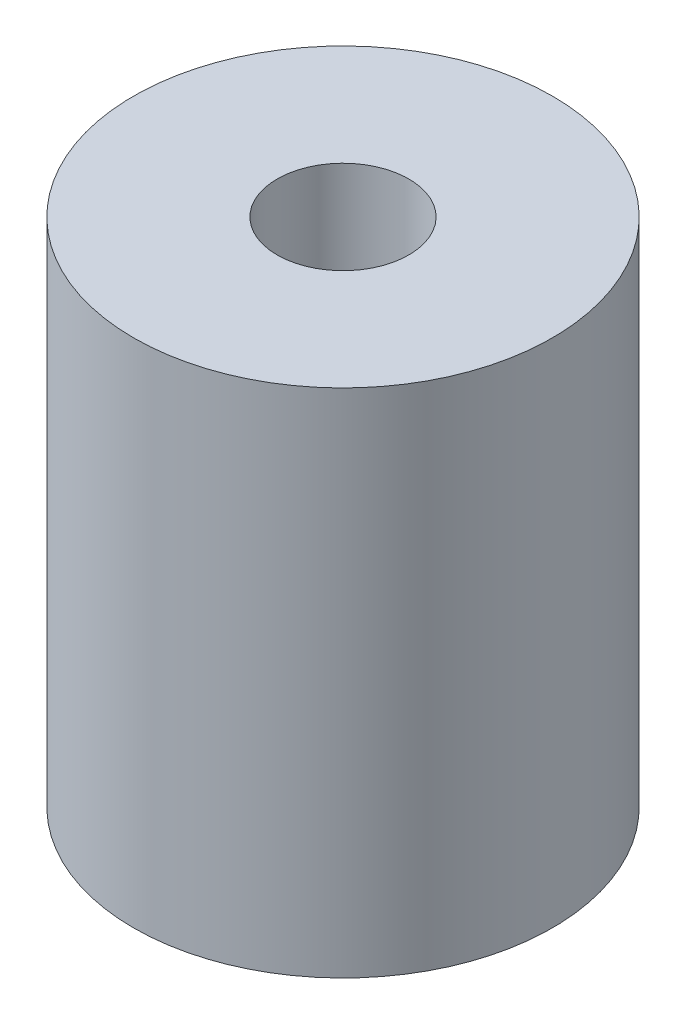
ISO-10303-21;
HEADER;
FILE_DESCRIPTION(('STEP AP214'),'2;1');
FILE_NAME('part.step','',(''),(''),'','','');
FILE_SCHEMA(('AUTOMOTIVE_DESIGN { 1 0 10303 214 1 1 1 1 }'));
ENDSEC;
DATA;
#1=APPLICATION_CONTEXT('core data for automotive mechanical design processes');
#2=APPLICATION_PROTOCOL_DEFINITION('international standard','automotive_design',2000,#1);
#3=PRODUCT_CONTEXT('',#1,'mechanical');
#4=PRODUCT('Part','Part','',(#3));
#5=PRODUCT_RELATED_PRODUCT_CATEGORY('part','',(#4));
#6=PRODUCT_DEFINITION_FORMATION('','',#4);
#7=PRODUCT_DEFINITION_CONTEXT('part definition',#1,'design');
#8=PRODUCT_DEFINITION('design','',#6,#7);
#9=PRODUCT_DEFINITION_SHAPE('','',#8);
#10=(LENGTH_UNIT() NAMED_UNIT(*) SI_UNIT(.MILLI.,.METRE.));
#11=(NAMED_UNIT(*) PLANE_ANGLE_UNIT() SI_UNIT($,.RADIAN.));
#12=(NAMED_UNIT(*) SI_UNIT($,.STERADIAN.) SOLID_ANGLE_UNIT());
#13=UNCERTAINTY_MEASURE_WITH_UNIT(LENGTH_MEASURE(1.E-05),#10,'distance_accuracy_value','');
#14=(GEOMETRIC_REPRESENTATION_CONTEXT(3) GLOBAL_UNCERTAINTY_ASSIGNED_CONTEXT((#13)) GLOBAL_UNIT_ASSIGNED_CONTEXT((#10,
#11,#12)) REPRESENTATION_CONTEXT('',''));
#15=CARTESIAN_POINT('',(0.,0.,0.));
#16=DIRECTION('',(0.,0.,1.));
#17=DIRECTION('',(1.,0.,0.));
#18=AXIS2_PLACEMENT_3D('',#15,#16,#17);
#19=CARTESIAN_POINT('',(0.,4.85,0.));
#20=DIRECTION('',(0.,-1.,0.));
#21=DIRECTION('',(0.,0.,-1.));
#22=AXIS2_PLACEMENT_3D('',#19,#20,#21);
#23=CYLINDRICAL_SURFACE('',#22,3.9751);
#24=CARTESIAN_POINT('',(0.,4.85,0.));
#25=DIRECTION('',(0.,1.,0.));
#26=DIRECTION('',(0.,0.,1.));
#27=AXIS2_PLACEMENT_3D('',#24,#25,#26);
#28=CIRCLE('',#27,3.9751);
#29=CARTESIAN_POINT('',(0.,4.85,3.9751));
#30=VERTEX_POINT('',#29);
#31=EDGE_CURVE('E10',#30,#30,#28,.T.);
#32=ORIENTED_EDGE('',*,*,#31,.F.);
#33=EDGE_LOOP('',(#32));
#34=FACE_BOUND('',#33,.T.);
#35=CARTESIAN_POINT('',(0.,-4.85,0.));
#36=DIRECTION('',(0.,1.,0.));
#37=DIRECTION('',(0.,0.,1.));
#38=AXIS2_PLACEMENT_3D('',#35,#36,#37);
#39=CIRCLE('',#38,3.9751);
#40=CARTESIAN_POINT('',(0.,-4.85,3.9751));
#41=VERTEX_POINT('',#40);
#42=EDGE_CURVE('E48',#41,#41,#39,.T.);
#43=ORIENTED_EDGE('',*,*,#42,.T.);
#44=EDGE_LOOP('',(#43));
#45=FACE_BOUND('',#44,.T.);
#46=ADVANCED_FACE('F45',(#34,#45),#23,.T.);
#47=CARTESIAN_POINT('',(0.,4.85,0.));
#48=DIRECTION('',(0.,1.,0.));
#49=DIRECTION('',(0.,0.,1.));
#50=AXIS2_PLACEMENT_3D('',#47,#48,#49);
#51=PLANE('',#50);
#52=CARTESIAN_POINT('',(0.,4.85,0.));
#53=DIRECTION('',(0.,1.,0.));
#54=DIRECTION('',(0.,0.,1.));
#55=AXIS2_PLACEMENT_3D('',#52,#53,#54);
#56=CIRCLE('',#55,1.25);
#57=CARTESIAN_POINT('',(0.,4.85,1.25));
#58=VERTEX_POINT('',#57);
#59=EDGE_CURVE('E59',#58,#58,#56,.T.);
#60=ORIENTED_EDGE('',*,*,#59,.F.);
#61=EDGE_LOOP('',(#60));
#62=FACE_BOUND('',#61,.T.);
#63=ORIENTED_EDGE('',*,*,#31,.T.);
#64=EDGE_LOOP('',(#63));
#65=FACE_BOUND('',#64,.T.);
#66=ADVANCED_FACE('F65',(#62,#65),#51,.T.);
#67=CARTESIAN_POINT('',(0.,-4.85,0.));
#68=DIRECTION('',(0.,1.,0.));
#69=DIRECTION('',(0.,0.,1.));
#70=AXIS2_PLACEMENT_3D('',#67,#68,#69);
#71=PLANE('',#70);
#72=CARTESIAN_POINT('',(0.,-4.85,0.));
#73=DIRECTION('',(0.,1.,0.));
#74=DIRECTION('',(0.,0.,1.));
#75=AXIS2_PLACEMENT_3D('',#72,#73,#74);
#76=CIRCLE('',#75,1.25);
#77=CARTESIAN_POINT('',(0.,-4.85,1.25));
#78=VERTEX_POINT('',#77);
#79=EDGE_CURVE('E55',#78,#78,#76,.T.);
#80=ORIENTED_EDGE('',*,*,#79,.T.);
#81=EDGE_LOOP('',(#80));
#82=FACE_BOUND('',#81,.T.);
#83=ORIENTED_EDGE('',*,*,#42,.F.);
#84=EDGE_LOOP('',(#83));
#85=FACE_BOUND('',#84,.T.);
#86=ADVANCED_FACE('F67',(#82,#85),#71,.F.);
#87=CARTESIAN_POINT('',(0.,4.85,0.));
#88=DIRECTION('',(0.,1.,0.));
#89=DIRECTION('',(0.,0.,1.));
#90=AXIS2_PLACEMENT_3D('',#87,#88,#89);
#91=CYLINDRICAL_SURFACE('',#90,1.25);
#92=ORIENTED_EDGE('',*,*,#79,.F.);
#93=EDGE_LOOP('',(#92));
#94=FACE_BOUND('',#93,.T.);
#95=ORIENTED_EDGE('',*,*,#59,.T.);
#96=EDGE_LOOP('',(#95));
#97=FACE_BOUND('',#96,.T.);
#98=ADVANCED_FACE('F63',(#94,#97),#91,.F.);
#99=CLOSED_SHELL('',(#46,#66,#86,#98));
#100=MANIFOLD_SOLID_BREP('B2',#99);
#101=ADVANCED_BREP_SHAPE_REPRESENTATION('',(#18,#100),#14);
#102=SHAPE_DEFINITION_REPRESENTATION(#9,#101);
ENDSEC;
END-ISO-10303-21;
